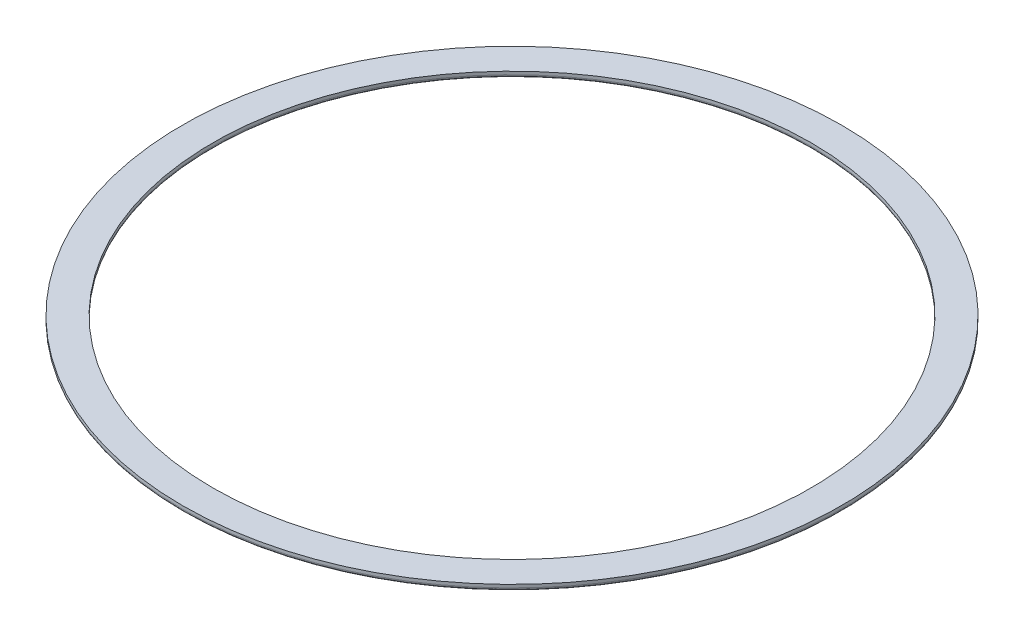
ISO-10303-21;
HEADER;
FILE_DESCRIPTION(('STEP AP214'),'2;1');
FILE_NAME('part.step','',(''),(''),'','','');
FILE_SCHEMA(('AUTOMOTIVE_DESIGN { 1 0 10303 214 1 1 1 1 }'));
ENDSEC;
DATA;
#1=APPLICATION_CONTEXT('core data for automotive mechanical design processes');
#2=APPLICATION_PROTOCOL_DEFINITION('international standard','automotive_design',2000,#1);
#3=PRODUCT_CONTEXT('',#1,'mechanical');
#4=PRODUCT('Part','Part','',(#3));
#5=PRODUCT_RELATED_PRODUCT_CATEGORY('part','',(#4));
#6=PRODUCT_DEFINITION_FORMATION('','',#4);
#7=PRODUCT_DEFINITION_CONTEXT('part definition',#1,'design');
#8=PRODUCT_DEFINITION('design','',#6,#7);
#9=PRODUCT_DEFINITION_SHAPE('','',#8);
#10=(LENGTH_UNIT() NAMED_UNIT(*) SI_UNIT(.MILLI.,.METRE.));
#11=(NAMED_UNIT(*) PLANE_ANGLE_UNIT() SI_UNIT($,.RADIAN.));
#12=(NAMED_UNIT(*) SI_UNIT($,.STERADIAN.) SOLID_ANGLE_UNIT());
#13=UNCERTAINTY_MEASURE_WITH_UNIT(LENGTH_MEASURE(1.E-05),#10,'distance_accuracy_value','');
#14=(GEOMETRIC_REPRESENTATION_CONTEXT(3) GLOBAL_UNCERTAINTY_ASSIGNED_CONTEXT((#13)) GLOBAL_UNIT_ASSIGNED_CONTEXT((#10,
#11,#12)) REPRESENTATION_CONTEXT('',''));
#15=CARTESIAN_POINT('',(0.,0.,0.));
#16=DIRECTION('',(0.,0.,1.));
#17=DIRECTION('',(1.,0.,0.));
#18=AXIS2_PLACEMENT_3D('',#15,#16,#17);
#19=CARTESIAN_POINT('',(166.750080550188,-53.1999315973919,-82.7209999999947));
#20=DIRECTION('',(0.,-1.,0.));
#21=DIRECTION('',(0.,0.,-1.));
#22=AXIS2_PLACEMENT_3D('',#19,#20,#21);
#23=PLANE('',#22);
#24=CARTESIAN_POINT('',(166.750080550188,-53.1999315973919,-82.7209999999947));
#25=DIRECTION('',(0.,-1.,0.));
#26=DIRECTION('',(0.,0.,-1.));
#27=AXIS2_PLACEMENT_3D('',#24,#25,#26);
#28=CIRCLE('',#27,9.89999999999999);
#29=CARTESIAN_POINT('',(166.750080550188,-53.1999315973919,-92.6209999999947));
#30=VERTEX_POINT('',#29);
#31=EDGE_CURVE('E68',#30,#30,#28,.T.);
#32=ORIENTED_EDGE('',*,*,#31,.F.);
#33=EDGE_LOOP('',(#32));
#34=FACE_BOUND('',#33,.T.);
#35=CARTESIAN_POINT('',(166.750080550188,-53.1999315973919,-82.7209999999947));
#36=DIRECTION('',(0.,1.,0.));
#37=DIRECTION('',(0.,0.,1.));
#38=AXIS2_PLACEMENT_3D('',#35,#36,#37);
#39=CIRCLE('',#38,10.7);
#40=CARTESIAN_POINT('',(166.750080550188,-53.1999315973919,-72.0209999999947));
#41=VERTEX_POINT('',#40);
#42=EDGE_CURVE('E55',#41,#41,#39,.T.);
#43=ORIENTED_EDGE('',*,*,#42,.F.);
#44=EDGE_LOOP('',(#43));
#45=FACE_BOUND('',#44,.T.);
#46=ADVANCED_FACE('F15',(#34,#45),#23,.T.);
#47=CARTESIAN_POINT('',(166.750080550188,-53.0999315973919,-82.7209999999947));
#48=DIRECTION('',(0.,-1.,0.));
#49=DIRECTION('',(0.,0.,-1.));
#50=AXIS2_PLACEMENT_3D('',#47,#48,#49);
#51=TOROIDAL_SURFACE('',#50,10.7,0.1);
#52=CARTESIAN_POINT('',(166.750080550188,-53.0999315973919,-82.7209999999947));
#53=DIRECTION('',(0.,-1.,0.));
#54=DIRECTION('',(0.,0.,-1.));
#55=AXIS2_PLACEMENT_3D('',#52,#53,#54);
#56=CIRCLE('',#55,10.8);
#57=CARTESIAN_POINT('',(166.750080550188,-53.0999315973919,-93.5209999999947));
#58=VERTEX_POINT('',#57);
#59=EDGE_CURVE('E85',#58,#58,#56,.F.);
#60=ORIENTED_EDGE('',*,*,#59,.F.);
#61=EDGE_LOOP('',(#60));
#62=FACE_BOUND('',#61,.T.);
#63=ORIENTED_EDGE('',*,*,#42,.T.);
#64=EDGE_LOOP('',(#63));
#65=FACE_BOUND('',#64,.T.);
#66=ADVANCED_FACE('F33',(#62,#65),#51,.T.);
#67=CARTESIAN_POINT('',(166.750080550188,-53.0999315973919,-82.7209999999947));
#68=DIRECTION('',(0.,1.,0.));
#69=DIRECTION('',(0.,0.,1.));
#70=AXIS2_PLACEMENT_3D('',#67,#68,#69);
#71=TOROIDAL_SURFACE('',#70,9.90000000000001,0.1);
#72=CARTESIAN_POINT('',(166.750080550188,-53.0999315973919,-82.7209999999947));
#73=DIRECTION('',(0.,-1.,0.));
#74=DIRECTION('',(0.,0.,-1.));
#75=AXIS2_PLACEMENT_3D('',#72,#73,#74);
#76=CIRCLE('',#75,9.8);
#77=CARTESIAN_POINT('',(166.750080550188,-53.0999315973919,-92.5209999999947));
#78=VERTEX_POINT('',#77);
#79=EDGE_CURVE('E26',#78,#78,#76,.F.);
#80=ORIENTED_EDGE('',*,*,#79,.T.);
#81=EDGE_LOOP('',(#80));
#82=FACE_BOUND('',#81,.T.);
#83=ORIENTED_EDGE('',*,*,#31,.T.);
#84=EDGE_LOOP('',(#83));
#85=FACE_BOUND('',#84,.T.);
#86=ADVANCED_FACE('F43',(#82,#85),#71,.T.);
#87=CARTESIAN_POINT('',(166.750080550188,-52.9999315973919,-82.7209999999947));
#88=DIRECTION('',(0.,-1.,0.));
#89=DIRECTION('',(0.,0.,-1.));
#90=AXIS2_PLACEMENT_3D('',#87,#88,#89);
#91=CYLINDRICAL_SURFACE('',#90,10.8);
#92=CARTESIAN_POINT('',(166.750080550188,-52.9999315973919,-82.7209999999947));
#93=DIRECTION('',(0.,-1.,0.));
#94=DIRECTION('',(0.,0.,-1.));
#95=AXIS2_PLACEMENT_3D('',#92,#93,#94);
#96=CIRCLE('',#95,10.8);
#97=CARTESIAN_POINT('',(166.750080550188,-52.9999315973919,-93.5209999999947));
#98=VERTEX_POINT('',#97);
#99=EDGE_CURVE('E19',#98,#98,#96,.T.);
#100=ORIENTED_EDGE('',*,*,#99,.T.);
#101=EDGE_LOOP('',(#100));
#102=FACE_BOUND('',#101,.T.);
#103=ORIENTED_EDGE('',*,*,#59,.T.);
#104=EDGE_LOOP('',(#103));
#105=FACE_BOUND('',#104,.T.);
#106=ADVANCED_FACE('F98',(#102,#105),#91,.T.);
#107=CARTESIAN_POINT('',(166.750080550188,-52.9999315973919,-82.7209999999947));
#108=DIRECTION('',(0.,-1.,0.));
#109=DIRECTION('',(0.,0.,-1.));
#110=AXIS2_PLACEMENT_3D('',#107,#108,#109);
#111=CYLINDRICAL_SURFACE('',#110,9.8);
#112=CARTESIAN_POINT('',(166.750080550188,-52.9999315973919,-82.7209999999947));
#113=DIRECTION('',(0.,-1.,0.));
#114=DIRECTION('',(0.,0.,-1.));
#115=AXIS2_PLACEMENT_3D('',#112,#113,#114);
#116=CIRCLE('',#115,9.8);
#117=CARTESIAN_POINT('',(166.750080550188,-52.9999315973919,-92.5209999999947));
#118=VERTEX_POINT('',#117);
#119=EDGE_CURVE('E10',#118,#118,#116,.F.);
#120=ORIENTED_EDGE('',*,*,#119,.T.);
#121=EDGE_LOOP('',(#120));
#122=FACE_BOUND('',#121,.T.);
#123=ORIENTED_EDGE('',*,*,#79,.F.);
#124=EDGE_LOOP('',(#123));
#125=FACE_BOUND('',#124,.T.);
#126=ADVANCED_FACE('F95',(#122,#125),#111,.F.);
#127=CARTESIAN_POINT('',(166.750080550188,-52.9999315973919,-82.7209999999947));
#128=DIRECTION('',(0.,-1.,0.));
#129=DIRECTION('',(0.,0.,-1.));
#130=AXIS2_PLACEMENT_3D('',#127,#128,#129);
#131=PLANE('',#130);
#132=ORIENTED_EDGE('',*,*,#119,.F.);
#133=EDGE_LOOP('',(#132));
#134=FACE_BOUND('',#133,.T.);
#135=ORIENTED_EDGE('',*,*,#99,.F.);
#136=EDGE_LOOP('',(#135));
#137=FACE_BOUND('',#136,.T.);
#138=ADVANCED_FACE('F97',(#134,#137),#131,.F.);
#139=CLOSED_SHELL('',(#46,#66,#86,#106,#126,#138));
#140=MANIFOLD_SOLID_BREP('B1',#139);
#141=ADVANCED_BREP_SHAPE_REPRESENTATION('',(#18,#140),#14);
#142=SHAPE_DEFINITION_REPRESENTATION(#9,#141);
ENDSEC;
END-ISO-10303-21;
